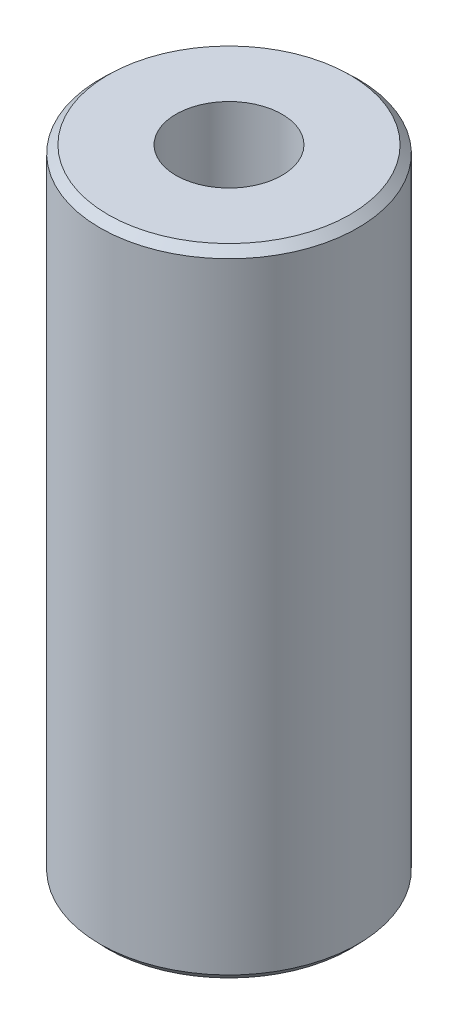
ISO-10303-21;
HEADER;
FILE_DESCRIPTION(('STEP AP214'),'2;1');
FILE_NAME('part.step','',(''),(''),'','','');
FILE_SCHEMA(('AUTOMOTIVE_DESIGN { 1 0 10303 214 1 1 1 1 }'));
ENDSEC;
DATA;
#1=APPLICATION_CONTEXT('core data for automotive mechanical design processes');
#2=APPLICATION_PROTOCOL_DEFINITION('international standard','automotive_design',2000,#1);
#3=PRODUCT_CONTEXT('',#1,'mechanical');
#4=PRODUCT('Part','Part','',(#3));
#5=PRODUCT_RELATED_PRODUCT_CATEGORY('part','',(#4));
#6=PRODUCT_DEFINITION_FORMATION('','',#4);
#7=PRODUCT_DEFINITION_CONTEXT('part definition',#1,'design');
#8=PRODUCT_DEFINITION('design','',#6,#7);
#9=PRODUCT_DEFINITION_SHAPE('','',#8);
#10=(LENGTH_UNIT() NAMED_UNIT(*) SI_UNIT(.MILLI.,.METRE.));
#11=(NAMED_UNIT(*) PLANE_ANGLE_UNIT() SI_UNIT($,.RADIAN.));
#12=(NAMED_UNIT(*) SI_UNIT($,.STERADIAN.) SOLID_ANGLE_UNIT());
#13=UNCERTAINTY_MEASURE_WITH_UNIT(LENGTH_MEASURE(1.E-05),#10,'distance_accuracy_value','');
#14=(GEOMETRIC_REPRESENTATION_CONTEXT(3) GLOBAL_UNCERTAINTY_ASSIGNED_CONTEXT((#13)) GLOBAL_UNIT_ASSIGNED_CONTEXT((#10,
#11,#12)) REPRESENTATION_CONTEXT('',''));
#15=CARTESIAN_POINT('',(0.,0.,0.));
#16=DIRECTION('',(0.,0.,1.));
#17=DIRECTION('',(1.,0.,0.));
#18=AXIS2_PLACEMENT_3D('',#15,#16,#17);
#19=CARTESIAN_POINT('',(0.,295.857203788535,0.));
#20=DIRECTION('',(0.,-1.,0.));
#21=DIRECTION('',(0.,0.,-1.));
#22=AXIS2_PLACEMENT_3D('',#19,#20,#21);
#23=CYLINDRICAL_SURFACE('',#22,60.);
#24=CARTESIAN_POINT('',(0.,292.343274750543,0.));
#25=DIRECTION('',(0.,1.,0.));
#26=DIRECTION('',(0.,0.,1.));
#27=AXIS2_PLACEMENT_3D('',#24,#25,#26);
#28=CIRCLE('',#27,60.);
#29=CARTESIAN_POINT('',(0.,292.343274750543,60.));
#30=VERTEX_POINT('',#29);
#31=EDGE_CURVE('E50',#30,#30,#28,.F.);
#32=ORIENTED_EDGE('',*,*,#31,.T.);
#33=EDGE_LOOP('',(#32));
#34=FACE_BOUND('',#33,.T.);
#35=CARTESIAN_POINT('',(0.,3.69609807603694,0.));
#36=DIRECTION('',(0.,1.,0.));
#37=DIRECTION('',(0.,0.,1.));
#38=AXIS2_PLACEMENT_3D('',#35,#36,#37);
#39=CIRCLE('',#38,60.);
#40=CARTESIAN_POINT('',(0.,3.69609807603694,60.));
#41=VERTEX_POINT('',#40);
#42=EDGE_CURVE('E51',#41,#41,#39,.T.);
#43=ORIENTED_EDGE('',*,*,#42,.T.);
#44=EDGE_LOOP('',(#43));
#45=FACE_BOUND('',#44,.T.);
#46=ADVANCED_FACE('F39',(#34,#45),#23,.T.);
#47=CARTESIAN_POINT('',(0.,295.857203788535,0.));
#48=DIRECTION('',(0.,1.,0.));
#49=DIRECTION('',(0.,0.,1.));
#50=AXIS2_PLACEMENT_3D('',#47,#48,#49);
#51=PLANE('',#50);
#52=CARTESIAN_POINT('',(0.,295.857203788535,0.));
#53=DIRECTION('',(0.,1.,0.));
#54=DIRECTION('',(0.,0.,1.));
#55=AXIS2_PLACEMENT_3D('',#52,#53,#54);
#56=CIRCLE('',#55,56.3039019239631);
#57=CARTESIAN_POINT('',(0.,295.857203788535,56.3039019239631));
#58=VERTEX_POINT('',#57);
#59=EDGE_CURVE('E54',#58,#58,#56,.T.);
#60=ORIENTED_EDGE('',*,*,#59,.T.);
#61=EDGE_LOOP('',(#60));
#62=FACE_BOUND('',#61,.T.);
#63=CARTESIAN_POINT('',(0.,295.857203788535,0.));
#64=DIRECTION('',(0.,1.,0.));
#65=DIRECTION('',(0.,0.,1.));
#66=AXIS2_PLACEMENT_3D('',#63,#64,#65);
#67=CIRCLE('',#66,24.6749741144439);
#68=CARTESIAN_POINT('',(0.,295.857203788535,24.6749741144439));
#69=VERTEX_POINT('',#68);
#70=EDGE_CURVE('E58',#69,#69,#67,.T.);
#71=ORIENTED_EDGE('',*,*,#70,.F.);
#72=EDGE_LOOP('',(#71));
#73=FACE_BOUND('',#72,.T.);
#74=ADVANCED_FACE('F69',(#62,#73),#51,.T.);
#75=CARTESIAN_POINT('',(0.,0.,0.));
#76=DIRECTION('',(0.,1.,0.));
#77=DIRECTION('',(0.,0.,1.));
#78=AXIS2_PLACEMENT_3D('',#75,#76,#77);
#79=PLANE('',#78);
#80=CARTESIAN_POINT('',(0.,0.,0.));
#81=DIRECTION('',(0.,1.,0.));
#82=DIRECTION('',(0.,0.,1.));
#83=AXIS2_PLACEMENT_3D('',#80,#81,#82);
#84=CIRCLE('',#83,56.4860709620086);
#85=CARTESIAN_POINT('',(0.,0.,56.4860709620086));
#86=VERTEX_POINT('',#85);
#87=EDGE_CURVE('E10',#86,#86,#84,.F.);
#88=ORIENTED_EDGE('',*,*,#87,.T.);
#89=EDGE_LOOP('',(#88));
#90=FACE_BOUND('',#89,.T.);
#91=CARTESIAN_POINT('',(0.,0.,0.));
#92=DIRECTION('',(0.,1.,0.));
#93=DIRECTION('',(0.,0.,1.));
#94=AXIS2_PLACEMENT_3D('',#91,#92,#93);
#95=CIRCLE('',#94,24.6749741144439);
#96=CARTESIAN_POINT('',(0.,0.,24.6749741144439));
#97=VERTEX_POINT('',#96);
#98=EDGE_CURVE('E63',#97,#97,#95,.T.);
#99=ORIENTED_EDGE('',*,*,#98,.T.);
#100=EDGE_LOOP('',(#99));
#101=FACE_BOUND('',#100,.T.);
#102=ADVANCED_FACE('F75',(#90,#101),#79,.F.);
#103=CARTESIAN_POINT('',(0.,295.857203788535,0.));
#104=DIRECTION('',(0.,-1.,0.));
#105=DIRECTION('',(0.,0.,-1.));
#106=AXIS2_PLACEMENT_3D('',#103,#104,#105);
#107=CYLINDRICAL_SURFACE('',#106,24.6749741144439);
#108=ORIENTED_EDGE('',*,*,#70,.T.);
#109=EDGE_LOOP('',(#108));
#110=FACE_BOUND('',#109,.T.);
#111=ORIENTED_EDGE('',*,*,#98,.F.);
#112=EDGE_LOOP('',(#111));
#113=FACE_BOUND('',#112,.T.);
#114=ADVANCED_FACE('F70',(#110,#113),#107,.F.);
#115=CARTESIAN_POINT('',(0.,295.857203788535,0.));
#116=DIRECTION('',(0.,-1.,0.));
#117=DIRECTION('',(0.,0.,-1.));
#118=AXIS2_PLACEMENT_3D('',#115,#116,#117);
#119=CONICAL_SURFACE('',#118,56.3039019239631,0.810658857428215);
#120=ORIENTED_EDGE('',*,*,#31,.F.);
#121=EDGE_LOOP('',(#120));
#122=FACE_BOUND('',#121,.T.);
#123=ORIENTED_EDGE('',*,*,#59,.F.);
#124=EDGE_LOOP('',(#123));
#125=FACE_BOUND('',#124,.T.);
#126=ADVANCED_FACE('F81',(#122,#125),#119,.T.);
#127=CARTESIAN_POINT('',(0.,3.69609807603694,0.));
#128=DIRECTION('',(0.,1.,0.));
#129=DIRECTION('',(0.,0.,1.));
#130=AXIS2_PLACEMENT_3D('',#127,#128,#129);
#131=CONICAL_SURFACE('',#130,60.,0.760137469366678);
#132=CARTESIAN_POINT('',(0.,0.,56.4860709620086));
#133=CARTESIAN_POINT('',(0.,0.038501021625386,56.5226743894877));
#134=CARTESIAN_POINT('',(0.,0.0770020432507702,56.5592778169668));
#135=CARTESIAN_POINT('',(0.,0.154004086501539,56.6324846719249));
#136=CARTESIAN_POINT('',(0.,0.192505108126923,56.669088099404));
#137=CARTESIAN_POINT('',(0.,0.269507151377692,56.7422949543622));
#138=CARTESIAN_POINT('',(0.,0.308008173003077,56.7788983818412));
#139=CARTESIAN_POINT('',(0.,0.385010216253847,56.8521052367994));
#140=CARTESIAN_POINT('',(0.,0.423511237879233,56.8887086642785));
#141=CARTESIAN_POINT('',(0.,0.500513281130002,56.9619155192366));
#142=CARTESIAN_POINT('',(0.,0.539014302755385,56.9985189467157));
#143=CARTESIAN_POINT('',(0.,0.616016346006155,57.0717258016738));
#144=CARTESIAN_POINT('',(0.,0.654517367631541,57.1083292291529));
#145=CARTESIAN_POINT('',(0.,0.73151941088231,57.1815360841111));
#146=CARTESIAN_POINT('',(0.,0.770020432507694,57.2181395115902));
#147=CARTESIAN_POINT('',(0.,0.847022475758463,57.2913463665483));
#148=CARTESIAN_POINT('',(0.,0.885523497383848,57.3279497940274));
#149=CARTESIAN_POINT('',(0.,0.962525540634619,57.4011566489855));
#150=CARTESIAN_POINT('',(0.,1.00102656226,57.4377600764646));
#151=CARTESIAN_POINT('',(0.,1.07802860551077,57.5109669314228));
#152=CARTESIAN_POINT('',(0.,1.11652962713616,57.5475703589018));
#153=CARTESIAN_POINT('',(0.,1.19353167038693,57.62077721386));
#154=CARTESIAN_POINT('',(0.,1.23203269201231,57.6573806413391));
#155=CARTESIAN_POINT('',(0.,1.30903473526308,57.7305874962972));
#156=CARTESIAN_POINT('',(0.,1.34753575688847,57.7671909237763));
#157=CARTESIAN_POINT('',(0.,1.42453780013924,57.8403977787345));
#158=CARTESIAN_POINT('',(0.,1.46303882176462,57.8770012062135));
#159=CARTESIAN_POINT('',(0.,1.54004086501539,57.9502080611717));
#160=CARTESIAN_POINT('',(0.,1.57854188664077,57.9868114886508));
#161=CARTESIAN_POINT('',(0.,1.65554392989154,58.0600183436089));
#162=CARTESIAN_POINT('',(0.,1.69404495151693,58.096621771088));
#163=CARTESIAN_POINT('',(0.,1.7710469947677,58.1698286260462));
#164=CARTESIAN_POINT('',(0.,1.80954801639308,58.2064320535252));
#165=CARTESIAN_POINT('',(0.,1.88655005964385,58.2796389084834));
#166=CARTESIAN_POINT('',(0.,1.92505108126924,58.3162423359625));
#167=CARTESIAN_POINT('',(0.,2.00205312452001,58.3894491909206));
#168=CARTESIAN_POINT('',(0.,2.04055414614539,58.4260526183997));
#169=CARTESIAN_POINT('',(0.,2.11755618939616,58.4992594733578));
#170=CARTESIAN_POINT('',(0.,2.15605721102155,58.5358629008369));
#171=CARTESIAN_POINT('',(0.,2.23305925427232,58.6090697557951));
#172=CARTESIAN_POINT('',(0.,2.2715602758977,58.6456731832741));
#173=CARTESIAN_POINT('',(0.,2.34856231914847,58.7188800382323));
#174=CARTESIAN_POINT('',(0.,2.38706334077385,58.7554834657114));
#175=CARTESIAN_POINT('',(0.,2.46406538402462,58.8286903206695));
#176=CARTESIAN_POINT('',(0.,2.50256640565001,58.8652937481486));
#177=CARTESIAN_POINT('',(0.,2.57956844890078,58.9385006031068));
#178=CARTESIAN_POINT('',(0.,2.61806947052616,58.9751040305858));
#179=CARTESIAN_POINT('',(0.,2.69507151377693,59.048310885544));
#180=CARTESIAN_POINT('',(0.,2.73357253540232,59.0849143130231));
#181=CARTESIAN_POINT('',(0.,2.81057457865309,59.1581211679812));
#182=CARTESIAN_POINT('',(0.,2.84907560027847,59.1947245954603));
#183=CARTESIAN_POINT('',(0.,2.92607764352924,59.2679314504185));
#184=CARTESIAN_POINT('',(0.,2.96457866515462,59.3045348778975));
#185=CARTESIAN_POINT('',(0.,3.04158070840539,59.3777417328557));
#186=CARTESIAN_POINT('',(0.,3.08008173003078,59.4143451603348));
#187=CARTESIAN_POINT('',(0.,3.15708377328155,59.4875520152929));
#188=CARTESIAN_POINT('',(0.,3.19558479490693,59.524155442772));
#189=CARTESIAN_POINT('',(0.,3.2725868381577,59.5973622977302));
#190=CARTESIAN_POINT('',(0.,3.31108785978309,59.6339657252092));
#191=CARTESIAN_POINT('',(0.,3.38808990303386,59.7071725801674));
#192=CARTESIAN_POINT('',(0.,3.42659092465924,59.7437760076465));
#193=CARTESIAN_POINT('',(0.,3.50359296791001,59.8169828626046));
#194=CARTESIAN_POINT('',(0.,3.5420939895354,59.8535862900837));
#195=CARTESIAN_POINT('',(0.,3.61909603278616,59.9267931450418));
#196=CARTESIAN_POINT('',(0.,3.65759705441155,59.9633965725209));
#197=CARTESIAN_POINT('',(0.,3.69609807603694,60.));
#198=B_SPLINE_CURVE_WITH_KNOTS('',3,(#132,#133,#134,#135,#136,#137,#138,#139,#140,#141,#142,
#143,#144,#145,#146,#147,#148,#149,#150,#151,#152,#153,#154,#155,#156,#157,#158,#159,#160,#161,
#162,#163,#164,#165,#166,#167,#168,#169,#170,#171,#172,#173,#174,#175,#176,#177,#178,#179,#180,
#181,#182,#183,#184,#185,#186,#187,#188,#189,#190,#191,#192,#193,#194,#195,#196,#197),
.UNSPECIFIED.,.F.,.F.,(4,2,2,2,2,2,2,2,2,2,2,2,2,2,2,2,2,2,2,2,2,2,2,2,2,2,2,2,2,2,2,2,4),(0.,
0.15937144074372,0.318742881487444,0.478114322231164,0.637485762974883,0.796857203718607,
0.956228644462327,1.11560008520605,1.27497152594977,1.43434296669349,1.59371440743722,
1.75308584818093,1.91245728892465,2.07182872966838,2.2312001704121,2.39057161115582,
2.54994305189954,2.70931449264326,2.86868593338699,3.02805737413071,3.18742881487443,
3.34680025561815,3.50617169636187,3.66554313710559,3.82491457784931,3.98428601859303,
4.14365745933676,4.30302890008048,4.4624003408242,4.62177178156792,4.78114322231164,
4.94051466305536,5.09988610379908),.UNSPECIFIED.);
#199=EDGE_CURVE('BSEAM45',#86,#41,#198,.T.);
#200=ORIENTED_EDGE('',*,*,#87,.F.);
#201=ORIENTED_EDGE('',*,*,#42,.F.);
#202=ORIENTED_EDGE('',*,*,#199,.T.);
#203=ORIENTED_EDGE('',*,*,#199,.F.);
#204=EDGE_LOOP('',(#200,#202,#201,#203));
#205=FACE_BOUND('',#204,.T.);
#206=ADVANCED_FACE('F45',(#205),#131,.T.);
#207=CLOSED_SHELL('',(#46,#74,#102,#114,#126,#206));
#208=MANIFOLD_SOLID_BREP('B2',#207);
#209=ADVANCED_BREP_SHAPE_REPRESENTATION('',(#18,#208),#14);
#210=SHAPE_DEFINITION_REPRESENTATION(#9,#209);
ENDSEC;
END-ISO-10303-21;
